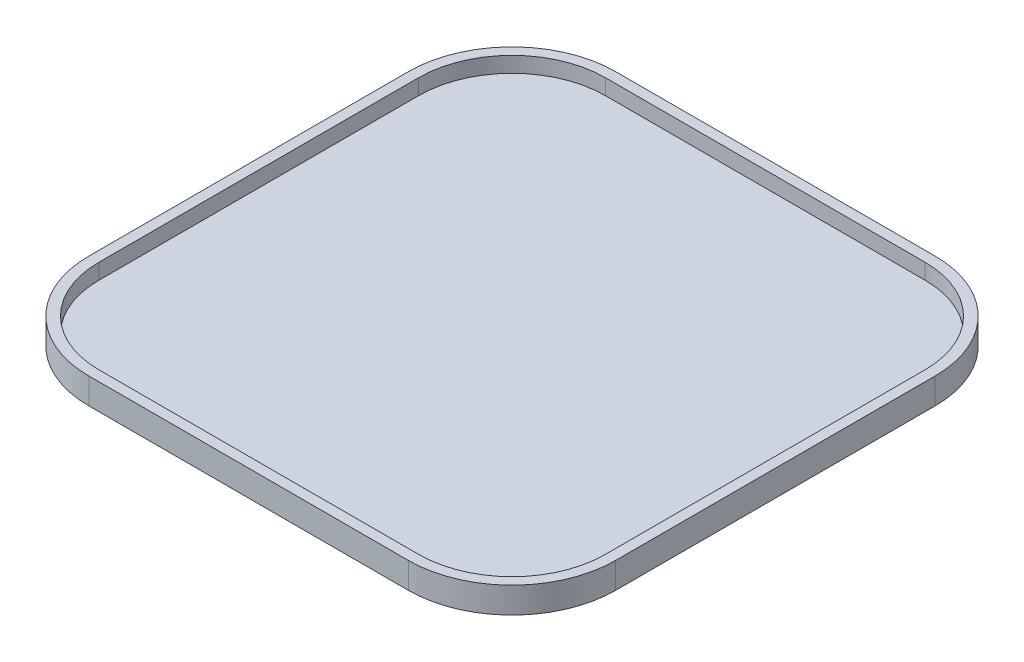
ISO-10303-21;
HEADER;
FILE_DESCRIPTION(('STEP AP214'),'2;1');
FILE_NAME('part.step','',(''),(''),'','','');
FILE_SCHEMA(('AUTOMOTIVE_DESIGN { 1 0 10303 214 1 1 1 1 }'));
ENDSEC;
DATA;
#1=APPLICATION_CONTEXT('core data for automotive mechanical design processes');
#2=APPLICATION_PROTOCOL_DEFINITION('international standard','automotive_design',2000,#1);
#3=PRODUCT_CONTEXT('',#1,'mechanical');
#4=PRODUCT('Part','Part','',(#3));
#5=PRODUCT_RELATED_PRODUCT_CATEGORY('part','',(#4));
#6=PRODUCT_DEFINITION_FORMATION('','',#4);
#7=PRODUCT_DEFINITION_CONTEXT('part definition',#1,'design');
#8=PRODUCT_DEFINITION('design','',#6,#7);
#9=PRODUCT_DEFINITION_SHAPE('','',#8);
#10=(LENGTH_UNIT() NAMED_UNIT(*) SI_UNIT(.MILLI.,.METRE.));
#11=(NAMED_UNIT(*) PLANE_ANGLE_UNIT() SI_UNIT($,.RADIAN.));
#12=(NAMED_UNIT(*) SI_UNIT($,.STERADIAN.) SOLID_ANGLE_UNIT());
#13=UNCERTAINTY_MEASURE_WITH_UNIT(LENGTH_MEASURE(1.E-05),#10,'distance_accuracy_value','');
#14=(GEOMETRIC_REPRESENTATION_CONTEXT(3) GLOBAL_UNCERTAINTY_ASSIGNED_CONTEXT((#13)) GLOBAL_UNIT_ASSIGNED_CONTEXT((#10,
#11,#12)) REPRESENTATION_CONTEXT('',''));
#15=CARTESIAN_POINT('',(0.,0.,0.));
#16=DIRECTION('',(0.,0.,1.));
#17=DIRECTION('',(1.,0.,0.));
#18=AXIS2_PLACEMENT_3D('',#15,#16,#17);
#19=CARTESIAN_POINT('',(30.8,5.,30.8));
#20=DIRECTION('',(0.,-1.,0.));
#21=DIRECTION('',(0.,0.,-1.));
#22=AXIS2_PLACEMENT_3D('',#19,#20,#21);
#23=CYLINDRICAL_SURFACE('',#22,20.);
#24=CARTESIAN_POINT('',(30.8,0.,30.8));
#25=DIRECTION('',(0.,1.,0.));
#26=DIRECTION('',(0.,0.,1.));
#27=AXIS2_PLACEMENT_3D('',#24,#25,#26);
#28=CIRCLE('',#27,20.);
#29=CARTESIAN_POINT('',(30.8,0.,50.8));
#30=VERTEX_POINT('',#29);
#31=CARTESIAN_POINT('',(50.8,0.,30.8));
#32=VERTEX_POINT('',#31);
#33=EDGE_CURVE('E142',#30,#32,#28,.T.);
#34=ORIENTED_EDGE('',*,*,#33,.T.);
#35=DIRECTION('',(0.,-1.,0.));
#36=VECTOR('',#35,1.);
#37=CARTESIAN_POINT('',(50.8,5.,30.8));
#38=LINE('',#37,#36);
#39=CARTESIAN_POINT('',(50.8,5.,30.8));
#40=VERTEX_POINT('',#39);
#41=EDGE_CURVE('E11',#40,#32,#38,.T.);
#42=ORIENTED_EDGE('',*,*,#41,.F.);
#43=CARTESIAN_POINT('',(30.8,5.,30.8));
#44=DIRECTION('',(0.,1.,0.));
#45=DIRECTION('',(0.,0.,1.));
#46=AXIS2_PLACEMENT_3D('',#43,#44,#45);
#47=CIRCLE('',#46,20.);
#48=CARTESIAN_POINT('',(30.8,5.,50.8));
#49=VERTEX_POINT('',#48);
#50=EDGE_CURVE('E158',#49,#40,#47,.T.);
#51=ORIENTED_EDGE('',*,*,#50,.F.);
#52=DIRECTION('',(0.,-1.,0.));
#53=VECTOR('',#52,1.);
#54=CARTESIAN_POINT('',(30.8,5.,50.8));
#55=LINE('',#54,#53);
#56=EDGE_CURVE('E138',#49,#30,#55,.T.);
#57=ORIENTED_EDGE('',*,*,#56,.T.);
#58=EDGE_LOOP('',(#34,#42,#51,#57));
#59=FACE_BOUND('',#58,.T.);
#60=ADVANCED_FACE('F35',(#59),#23,.T.);
#61=CARTESIAN_POINT('',(50.8,5.,30.8));
#62=DIRECTION('',(-1.,0.,0.));
#63=DIRECTION('',(0.,0.,1.));
#64=AXIS2_PLACEMENT_3D('',#61,#62,#63);
#65=PLANE('',#64);
#66=DIRECTION('',(0.,0.,-1.));
#67=VECTOR('',#66,1.);
#68=CARTESIAN_POINT('',(50.8,0.,30.8));
#69=LINE('',#68,#67);
#70=CARTESIAN_POINT('',(50.8,0.,-30.8));
#71=VERTEX_POINT('',#70);
#72=EDGE_CURVE('E145',#32,#71,#69,.T.);
#73=ORIENTED_EDGE('',*,*,#72,.T.);
#74=DIRECTION('',(0.,-1.,0.));
#75=VECTOR('',#74,1.);
#76=CARTESIAN_POINT('',(50.8,5.,-30.8));
#77=LINE('',#76,#75);
#78=CARTESIAN_POINT('',(50.8,5.,-30.8));
#79=VERTEX_POINT('',#78);
#80=EDGE_CURVE('E42',#79,#71,#77,.T.);
#81=ORIENTED_EDGE('',*,*,#80,.F.);
#82=DIRECTION('',(0.,0.,-1.));
#83=VECTOR('',#82,1.);
#84=CARTESIAN_POINT('',(50.8,5.,30.8));
#85=LINE('',#84,#83);
#86=EDGE_CURVE('E99',#40,#79,#85,.T.);
#87=ORIENTED_EDGE('',*,*,#86,.F.);
#88=ORIENTED_EDGE('',*,*,#41,.T.);
#89=EDGE_LOOP('',(#73,#81,#87,#88));
#90=FACE_BOUND('',#89,.T.);
#91=ADVANCED_FACE('F327',(#90),#65,.F.);
#92=CARTESIAN_POINT('',(30.8,5.,-30.8));
#93=DIRECTION('',(0.,-1.,0.));
#94=DIRECTION('',(0.,0.,-1.));
#95=AXIS2_PLACEMENT_3D('',#92,#93,#94);
#96=CYLINDRICAL_SURFACE('',#95,20.);
#97=CARTESIAN_POINT('',(30.8,0.,-30.8));
#98=DIRECTION('',(0.,1.,0.));
#99=DIRECTION('',(0.,0.,1.));
#100=AXIS2_PLACEMENT_3D('',#97,#98,#99);
#101=CIRCLE('',#100,20.);
#102=CARTESIAN_POINT('',(30.8,0.,-50.8));
#103=VERTEX_POINT('',#102);
#104=EDGE_CURVE('E148',#71,#103,#101,.T.);
#105=ORIENTED_EDGE('',*,*,#104,.T.);
#106=DIRECTION('',(0.,-1.,0.));
#107=VECTOR('',#106,1.);
#108=CARTESIAN_POINT('',(30.8,5.,-50.8));
#109=LINE('',#108,#107);
#110=CARTESIAN_POINT('',(30.8,5.,-50.8));
#111=VERTEX_POINT('',#110);
#112=EDGE_CURVE('E165',#111,#103,#109,.T.);
#113=ORIENTED_EDGE('',*,*,#112,.F.);
#114=CARTESIAN_POINT('',(30.8,5.,-30.8));
#115=DIRECTION('',(0.,1.,0.));
#116=DIRECTION('',(0.,0.,1.));
#117=AXIS2_PLACEMENT_3D('',#114,#115,#116);
#118=CIRCLE('',#117,20.);
#119=EDGE_CURVE('E173',#79,#111,#118,.T.);
#120=ORIENTED_EDGE('',*,*,#119,.F.);
#121=ORIENTED_EDGE('',*,*,#80,.T.);
#122=EDGE_LOOP('',(#105,#113,#120,#121));
#123=FACE_BOUND('',#122,.T.);
#124=ADVANCED_FACE('F171',(#123),#96,.T.);
#125=CARTESIAN_POINT('',(30.8,5.,-50.8));
#126=DIRECTION('',(0.,0.,1.));
#127=DIRECTION('',(1.,0.,0.));
#128=AXIS2_PLACEMENT_3D('',#125,#126,#127);
#129=PLANE('',#128);
#130=DIRECTION('',(-1.,0.,0.));
#131=VECTOR('',#130,1.);
#132=CARTESIAN_POINT('',(30.8,0.,-50.8));
#133=LINE('',#132,#131);
#134=CARTESIAN_POINT('',(-30.8,0.,-50.8));
#135=VERTEX_POINT('',#134);
#136=EDGE_CURVE('E150',#103,#135,#133,.T.);
#137=ORIENTED_EDGE('',*,*,#136,.T.);
#138=DIRECTION('',(0.,-1.,0.));
#139=VECTOR('',#138,1.);
#140=CARTESIAN_POINT('',(-30.8,5.,-50.8));
#141=LINE('',#140,#139);
#142=CARTESIAN_POINT('',(-30.8,5.,-50.8));
#143=VERTEX_POINT('',#142);
#144=EDGE_CURVE('E162',#143,#135,#141,.T.);
#145=ORIENTED_EDGE('',*,*,#144,.F.);
#146=DIRECTION('',(-1.,0.,0.));
#147=VECTOR('',#146,1.);
#148=CARTESIAN_POINT('',(30.8,5.,-50.8));
#149=LINE('',#148,#147);
#150=EDGE_CURVE('E185',#111,#143,#149,.T.);
#151=ORIENTED_EDGE('',*,*,#150,.F.);
#152=ORIENTED_EDGE('',*,*,#112,.T.);
#153=EDGE_LOOP('',(#137,#145,#151,#152));
#154=FACE_BOUND('',#153,.T.);
#155=ADVANCED_FACE('F181',(#154),#129,.F.);
#156=CARTESIAN_POINT('',(-30.8,5.,-30.8));
#157=DIRECTION('',(0.,-1.,0.));
#158=DIRECTION('',(0.,0.,-1.));
#159=AXIS2_PLACEMENT_3D('',#156,#157,#158);
#160=CYLINDRICAL_SURFACE('',#159,20.);
#161=CARTESIAN_POINT('',(-30.8,0.,-30.8));
#162=DIRECTION('',(0.,1.,0.));
#163=DIRECTION('',(0.,0.,1.));
#164=AXIS2_PLACEMENT_3D('',#161,#162,#163);
#165=CIRCLE('',#164,20.);
#166=CARTESIAN_POINT('',(-50.8,0.,-30.8));
#167=VERTEX_POINT('',#166);
#168=EDGE_CURVE('E152',#135,#167,#165,.T.);
#169=ORIENTED_EDGE('',*,*,#168,.T.);
#170=DIRECTION('',(0.,-1.,0.));
#171=VECTOR('',#170,1.);
#172=CARTESIAN_POINT('',(-50.8,5.,-30.8));
#173=LINE('',#172,#171);
#174=CARTESIAN_POINT('',(-50.8,5.,-30.8));
#175=VERTEX_POINT('',#174);
#176=EDGE_CURVE('E133',#175,#167,#173,.T.);
#177=ORIENTED_EDGE('',*,*,#176,.F.);
#178=CARTESIAN_POINT('',(-30.8,5.,-30.8));
#179=DIRECTION('',(0.,1.,0.));
#180=DIRECTION('',(0.,0.,1.));
#181=AXIS2_PLACEMENT_3D('',#178,#179,#180);
#182=CIRCLE('',#181,20.);
#183=EDGE_CURVE('E121',#143,#175,#182,.T.);
#184=ORIENTED_EDGE('',*,*,#183,.F.);
#185=ORIENTED_EDGE('',*,*,#144,.T.);
#186=EDGE_LOOP('',(#169,#177,#184,#185));
#187=FACE_BOUND('',#186,.T.);
#188=ADVANCED_FACE('F184',(#187),#160,.T.);
#189=CARTESIAN_POINT('',(-50.8,5.,30.8));
#190=DIRECTION('',(1.,0.,0.));
#191=DIRECTION('',(0.,0.,-1.));
#192=AXIS2_PLACEMENT_3D('',#189,#190,#191);
#193=PLANE('',#192);
#194=DIRECTION('',(0.,0.,1.));
#195=VECTOR('',#194,1.);
#196=CARTESIAN_POINT('',(-50.8,0.,30.8));
#197=LINE('',#196,#195);
#198=CARTESIAN_POINT('',(-50.8,0.,30.8));
#199=VERTEX_POINT('',#198);
#200=EDGE_CURVE('E130',#167,#199,#197,.T.);
#201=ORIENTED_EDGE('',*,*,#200,.T.);
#202=DIRECTION('',(0.,-1.,0.));
#203=VECTOR('',#202,1.);
#204=CARTESIAN_POINT('',(-50.8,5.,30.8));
#205=LINE('',#204,#203);
#206=CARTESIAN_POINT('',(-50.8,5.,30.8));
#207=VERTEX_POINT('',#206);
#208=EDGE_CURVE('E127',#207,#199,#205,.T.);
#209=ORIENTED_EDGE('',*,*,#208,.F.);
#210=DIRECTION('',(0.,0.,1.));
#211=VECTOR('',#210,1.);
#212=CARTESIAN_POINT('',(-50.8,5.,30.8));
#213=LINE('',#212,#211);
#214=EDGE_CURVE('E114',#175,#207,#213,.T.);
#215=ORIENTED_EDGE('',*,*,#214,.F.);
#216=ORIENTED_EDGE('',*,*,#176,.T.);
#217=EDGE_LOOP('',(#201,#209,#215,#216));
#218=FACE_BOUND('',#217,.T.);
#219=ADVANCED_FACE('F128',(#218),#193,.F.);
#220=CARTESIAN_POINT('',(-30.8,5.,30.8));
#221=DIRECTION('',(0.,-1.,0.));
#222=DIRECTION('',(0.,0.,-1.));
#223=AXIS2_PLACEMENT_3D('',#220,#221,#222);
#224=CYLINDRICAL_SURFACE('',#223,20.);
#225=CARTESIAN_POINT('',(-30.8,0.,30.8));
#226=DIRECTION('',(0.,1.,0.));
#227=DIRECTION('',(0.,0.,-1.));
#228=AXIS2_PLACEMENT_3D('',#225,#226,#227);
#229=CIRCLE('',#228,20.);
#230=CARTESIAN_POINT('',(-30.8,0.,50.8));
#231=VERTEX_POINT('',#230);
#232=EDGE_CURVE('E155',#199,#231,#229,.T.);
#233=ORIENTED_EDGE('',*,*,#232,.T.);
#234=DIRECTION('',(0.,-1.,0.));
#235=VECTOR('',#234,1.);
#236=CARTESIAN_POINT('',(-30.8,5.,50.8));
#237=LINE('',#236,#235);
#238=CARTESIAN_POINT('',(-30.8,5.,50.8));
#239=VERTEX_POINT('',#238);
#240=EDGE_CURVE('E134',#239,#231,#237,.T.);
#241=ORIENTED_EDGE('',*,*,#240,.F.);
#242=CARTESIAN_POINT('',(-30.8,5.,30.8));
#243=DIRECTION('',(0.,1.,0.));
#244=DIRECTION('',(0.,0.,-1.));
#245=AXIS2_PLACEMENT_3D('',#242,#243,#244);
#246=CIRCLE('',#245,20.);
#247=EDGE_CURVE('E118',#207,#239,#246,.T.);
#248=ORIENTED_EDGE('',*,*,#247,.F.);
#249=ORIENTED_EDGE('',*,*,#208,.T.);
#250=EDGE_LOOP('',(#233,#241,#248,#249));
#251=FACE_BOUND('',#250,.T.);
#252=ADVANCED_FACE('F136',(#251),#224,.T.);
#253=CARTESIAN_POINT('',(30.8,5.,50.8));
#254=DIRECTION('',(0.,0.,-1.));
#255=DIRECTION('',(-1.,0.,0.));
#256=AXIS2_PLACEMENT_3D('',#253,#254,#255);
#257=PLANE('',#256);
#258=DIRECTION('',(1.,0.,0.));
#259=VECTOR('',#258,1.);
#260=CARTESIAN_POINT('',(30.8,0.,50.8));
#261=LINE('',#260,#259);
#262=EDGE_CURVE('E91',#231,#30,#261,.T.);
#263=ORIENTED_EDGE('',*,*,#262,.T.);
#264=ORIENTED_EDGE('',*,*,#56,.F.);
#265=DIRECTION('',(1.,0.,0.));
#266=VECTOR('',#265,1.);
#267=CARTESIAN_POINT('',(30.8,5.,50.8));
#268=LINE('',#267,#266);
#269=EDGE_CURVE('E58',#239,#49,#268,.T.);
#270=ORIENTED_EDGE('',*,*,#269,.F.);
#271=ORIENTED_EDGE('',*,*,#240,.T.);
#272=EDGE_LOOP('',(#263,#264,#270,#271));
#273=FACE_BOUND('',#272,.T.);
#274=ADVANCED_FACE('F334',(#273),#257,.F.);
#275=CARTESIAN_POINT('',(30.8,5.,30.8));
#276=DIRECTION('',(0.,1.,0.));
#277=DIRECTION('',(0.,0.,1.));
#278=AXIS2_PLACEMENT_3D('',#275,#276,#277);
#279=PLANE('',#278);
#280=CARTESIAN_POINT('',(30.8,5.,30.8));
#281=DIRECTION('',(0.,1.,0.));
#282=DIRECTION('',(0.,0.,1.));
#283=AXIS2_PLACEMENT_3D('',#280,#281,#282);
#284=CIRCLE('',#283,18.);
#285=CARTESIAN_POINT('',(30.8,5.,48.8));
#286=VERTEX_POINT('',#285);
#287=CARTESIAN_POINT('',(48.8,5.,30.8));
#288=VERTEX_POINT('',#287);
#289=EDGE_CURVE('E211',#286,#288,#284,.T.);
#290=ORIENTED_EDGE('',*,*,#289,.F.);
#291=DIRECTION('',(1.,0.,0.));
#292=VECTOR('',#291,1.);
#293=CARTESIAN_POINT('',(30.8,5.,48.8));
#294=LINE('',#293,#292);
#295=CARTESIAN_POINT('',(-30.8,5.,48.8));
#296=VERTEX_POINT('',#295);
#297=EDGE_CURVE('E191',#296,#286,#294,.T.);
#298=ORIENTED_EDGE('',*,*,#297,.F.);
#299=CARTESIAN_POINT('',(-30.8,5.,30.8));
#300=DIRECTION('',(0.,1.,0.));
#301=DIRECTION('',(0.,0.,1.));
#302=AXIS2_PLACEMENT_3D('',#299,#300,#301);
#303=CIRCLE('',#302,18.);
#304=CARTESIAN_POINT('',(-48.8,5.,30.8));
#305=VERTEX_POINT('',#304);
#306=EDGE_CURVE('E194',#305,#296,#303,.T.);
#307=ORIENTED_EDGE('',*,*,#306,.F.);
#308=DIRECTION('',(0.,0.,1.));
#309=VECTOR('',#308,1.);
#310=CARTESIAN_POINT('',(-48.8,5.,30.8));
#311=LINE('',#310,#309);
#312=CARTESIAN_POINT('',(-48.8,5.,-30.8));
#313=VERTEX_POINT('',#312);
#314=EDGE_CURVE('E196',#313,#305,#311,.T.);
#315=ORIENTED_EDGE('',*,*,#314,.F.);
#316=CARTESIAN_POINT('',(-30.8,5.,-30.8));
#317=DIRECTION('',(0.,1.,0.));
#318=DIRECTION('',(0.,0.,1.));
#319=AXIS2_PLACEMENT_3D('',#316,#317,#318);
#320=CIRCLE('',#319,18.);
#321=CARTESIAN_POINT('',(-30.8,5.,-48.8));
#322=VERTEX_POINT('',#321);
#323=EDGE_CURVE('E199',#322,#313,#320,.T.);
#324=ORIENTED_EDGE('',*,*,#323,.F.);
#325=DIRECTION('',(-1.,0.,0.));
#326=VECTOR('',#325,1.);
#327=CARTESIAN_POINT('',(30.8,5.,-48.8));
#328=LINE('',#327,#326);
#329=CARTESIAN_POINT('',(30.8,5.,-48.8));
#330=VERTEX_POINT('',#329);
#331=EDGE_CURVE('E202',#330,#322,#328,.T.);
#332=ORIENTED_EDGE('',*,*,#331,.F.);
#333=CARTESIAN_POINT('',(30.8,5.,-30.8));
#334=DIRECTION('',(0.,1.,0.));
#335=DIRECTION('',(0.,0.,1.));
#336=AXIS2_PLACEMENT_3D('',#333,#334,#335);
#337=CIRCLE('',#336,18.);
#338=CARTESIAN_POINT('',(48.8,5.,-30.8));
#339=VERTEX_POINT('',#338);
#340=EDGE_CURVE('E205',#339,#330,#337,.T.);
#341=ORIENTED_EDGE('',*,*,#340,.F.);
#342=DIRECTION('',(0.,0.,-1.));
#343=VECTOR('',#342,1.);
#344=CARTESIAN_POINT('',(48.8,5.,30.8));
#345=LINE('',#344,#343);
#346=EDGE_CURVE('E208',#288,#339,#345,.T.);
#347=ORIENTED_EDGE('',*,*,#346,.F.);
#348=EDGE_LOOP('',(#290,#298,#307,#315,#324,#332,#341,#347));
#349=FACE_BOUND('',#348,.T.);
#350=ORIENTED_EDGE('',*,*,#50,.T.);
#351=ORIENTED_EDGE('',*,*,#86,.T.);
#352=ORIENTED_EDGE('',*,*,#119,.T.);
#353=ORIENTED_EDGE('',*,*,#150,.T.);
#354=ORIENTED_EDGE('',*,*,#183,.T.);
#355=ORIENTED_EDGE('',*,*,#214,.T.);
#356=ORIENTED_EDGE('',*,*,#247,.T.);
#357=ORIENTED_EDGE('',*,*,#269,.T.);
#358=EDGE_LOOP('',(#350,#351,#352,#353,#354,#355,#356,#357));
#359=FACE_BOUND('',#358,.T.);
#360=ADVANCED_FACE('F116',(#349,#359),#279,.T.);
#361=CARTESIAN_POINT('',(30.8,0.,30.8));
#362=DIRECTION('',(0.,1.,0.));
#363=DIRECTION('',(0.,0.,1.));
#364=AXIS2_PLACEMENT_3D('',#361,#362,#363);
#365=PLANE('',#364);
#366=ORIENTED_EDGE('',*,*,#33,.F.);
#367=ORIENTED_EDGE('',*,*,#262,.F.);
#368=ORIENTED_EDGE('',*,*,#232,.F.);
#369=ORIENTED_EDGE('',*,*,#200,.F.);
#370=ORIENTED_EDGE('',*,*,#168,.F.);
#371=ORIENTED_EDGE('',*,*,#136,.F.);
#372=ORIENTED_EDGE('',*,*,#104,.F.);
#373=ORIENTED_EDGE('',*,*,#72,.F.);
#374=EDGE_LOOP('',(#366,#367,#368,#369,#370,#371,#372,#373));
#375=FACE_BOUND('',#374,.T.);
#376=ADVANCED_FACE('F177',(#375),#365,.F.);
#377=CARTESIAN_POINT('',(30.8,5.,30.8));
#378=DIRECTION('',(0.,-1.,0.));
#379=DIRECTION('',(0.,0.,-1.));
#380=AXIS2_PLACEMENT_3D('',#377,#378,#379);
#381=CYLINDRICAL_SURFACE('',#380,18.);
#382=CARTESIAN_POINT('',(30.8,2.,30.8));
#383=DIRECTION('',(0.,1.,0.));
#384=DIRECTION('',(0.,0.,1.));
#385=AXIS2_PLACEMENT_3D('',#382,#383,#384);
#386=CIRCLE('',#385,18.);
#387=CARTESIAN_POINT('',(30.8,2.,48.8));
#388=VERTEX_POINT('',#387);
#389=CARTESIAN_POINT('',(48.8,2.,30.8));
#390=VERTEX_POINT('',#389);
#391=EDGE_CURVE('E251',#388,#390,#386,.T.);
#392=ORIENTED_EDGE('',*,*,#391,.F.);
#393=DIRECTION('',(0.,-1.,0.));
#394=VECTOR('',#393,1.);
#395=CARTESIAN_POINT('',(30.8,5.,48.8));
#396=LINE('',#395,#394);
#397=EDGE_CURVE('E193',#286,#388,#396,.T.);
#398=ORIENTED_EDGE('',*,*,#397,.F.);
#399=ORIENTED_EDGE('',*,*,#289,.T.);
#400=DIRECTION('',(0.,1.,0.));
#401=VECTOR('',#400,1.);
#402=CARTESIAN_POINT('',(48.8,5.,30.8));
#403=LINE('',#402,#401);
#404=EDGE_CURVE('E146',#288,#390,#403,.F.);
#405=ORIENTED_EDGE('',*,*,#404,.T.);
#406=EDGE_LOOP('',(#392,#398,#399,#405));
#407=FACE_BOUND('',#406,.T.);
#408=ADVANCED_FACE('F267',(#407),#381,.F.);
#409=CARTESIAN_POINT('',(48.8,5.,30.8));
#410=DIRECTION('',(-1.,0.,0.));
#411=DIRECTION('',(0.,0.,1.));
#412=AXIS2_PLACEMENT_3D('',#409,#410,#411);
#413=PLANE('',#412);
#414=DIRECTION('',(0.,0.,-1.));
#415=VECTOR('',#414,1.);
#416=CARTESIAN_POINT('',(48.8,2.,30.8));
#417=LINE('',#416,#415);
#418=CARTESIAN_POINT('',(48.8,2.,-30.8));
#419=VERTEX_POINT('',#418);
#420=EDGE_CURVE('E246',#390,#419,#417,.T.);
#421=ORIENTED_EDGE('',*,*,#420,.F.);
#422=ORIENTED_EDGE('',*,*,#404,.F.);
#423=ORIENTED_EDGE('',*,*,#346,.T.);
#424=DIRECTION('',(0.,-1.,0.));
#425=VECTOR('',#424,1.);
#426=CARTESIAN_POINT('',(48.8,5.,-30.8));
#427=LINE('',#426,#425);
#428=EDGE_CURVE('E243',#339,#419,#427,.T.);
#429=ORIENTED_EDGE('',*,*,#428,.T.);
#430=EDGE_LOOP('',(#421,#422,#423,#429));
#431=FACE_BOUND('',#430,.T.);
#432=ADVANCED_FACE('F297',(#431),#413,.T.);
#433=CARTESIAN_POINT('',(30.8,5.,-30.8));
#434=DIRECTION('',(0.,-1.,0.));
#435=DIRECTION('',(0.,0.,-1.));
#436=AXIS2_PLACEMENT_3D('',#433,#434,#435);
#437=CYLINDRICAL_SURFACE('',#436,18.);
#438=CARTESIAN_POINT('',(30.8,2.,-30.8));
#439=DIRECTION('',(0.,1.,0.));
#440=DIRECTION('',(0.,0.,1.));
#441=AXIS2_PLACEMENT_3D('',#438,#439,#440);
#442=CIRCLE('',#441,18.);
#443=CARTESIAN_POINT('',(30.8,2.,-48.8));
#444=VERTEX_POINT('',#443);
#445=EDGE_CURVE('E240',#419,#444,#442,.T.);
#446=ORIENTED_EDGE('',*,*,#445,.F.);
#447=ORIENTED_EDGE('',*,*,#428,.F.);
#448=ORIENTED_EDGE('',*,*,#340,.T.);
#449=DIRECTION('',(0.,1.,0.));
#450=VECTOR('',#449,1.);
#451=CARTESIAN_POINT('',(30.8,5.,-48.8));
#452=LINE('',#451,#450);
#453=EDGE_CURVE('E237',#330,#444,#452,.F.);
#454=ORIENTED_EDGE('',*,*,#453,.T.);
#455=EDGE_LOOP('',(#446,#447,#448,#454));
#456=FACE_BOUND('',#455,.T.);
#457=ADVANCED_FACE('F303',(#456),#437,.F.);
#458=CARTESIAN_POINT('',(30.8,5.,-48.8));
#459=DIRECTION('',(0.,0.,1.));
#460=DIRECTION('',(1.,0.,0.));
#461=AXIS2_PLACEMENT_3D('',#458,#459,#460);
#462=PLANE('',#461);
#463=DIRECTION('',(-1.,0.,0.));
#464=VECTOR('',#463,1.);
#465=CARTESIAN_POINT('',(30.8,2.,-48.8));
#466=LINE('',#465,#464);
#467=CARTESIAN_POINT('',(-30.8,2.,-48.8));
#468=VERTEX_POINT('',#467);
#469=EDGE_CURVE('E234',#444,#468,#466,.T.);
#470=ORIENTED_EDGE('',*,*,#469,.F.);
#471=ORIENTED_EDGE('',*,*,#453,.F.);
#472=ORIENTED_EDGE('',*,*,#331,.T.);
#473=DIRECTION('',(0.,-1.,0.));
#474=VECTOR('',#473,1.);
#475=CARTESIAN_POINT('',(-30.8,5.,-48.8));
#476=LINE('',#475,#474);
#477=EDGE_CURVE('E231',#322,#468,#476,.T.);
#478=ORIENTED_EDGE('',*,*,#477,.T.);
#479=EDGE_LOOP('',(#470,#471,#472,#478));
#480=FACE_BOUND('',#479,.T.);
#481=ADVANCED_FACE('F414',(#480),#462,.T.);
#482=CARTESIAN_POINT('',(-30.8,5.,-30.8));
#483=DIRECTION('',(0.,-1.,0.));
#484=DIRECTION('',(0.,0.,-1.));
#485=AXIS2_PLACEMENT_3D('',#482,#483,#484);
#486=CYLINDRICAL_SURFACE('',#485,18.);
#487=CARTESIAN_POINT('',(-30.8,2.,-30.8));
#488=DIRECTION('',(0.,1.,0.));
#489=DIRECTION('',(0.,0.,1.));
#490=AXIS2_PLACEMENT_3D('',#487,#488,#489);
#491=CIRCLE('',#490,18.);
#492=CARTESIAN_POINT('',(-48.8,2.,-30.8));
#493=VERTEX_POINT('',#492);
#494=EDGE_CURVE('E228',#468,#493,#491,.T.);
#495=ORIENTED_EDGE('',*,*,#494,.F.);
#496=ORIENTED_EDGE('',*,*,#477,.F.);
#497=ORIENTED_EDGE('',*,*,#323,.T.);
#498=DIRECTION('',(0.,1.,0.));
#499=VECTOR('',#498,1.);
#500=CARTESIAN_POINT('',(-48.8,5.,-30.8));
#501=LINE('',#500,#499);
#502=EDGE_CURVE('E225',#313,#493,#501,.F.);
#503=ORIENTED_EDGE('',*,*,#502,.T.);
#504=EDGE_LOOP('',(#495,#496,#497,#503));
#505=FACE_BOUND('',#504,.T.);
#506=ADVANCED_FACE('F324',(#505),#486,.F.);
#507=CARTESIAN_POINT('',(-48.8,5.,30.8));
#508=DIRECTION('',(1.,0.,0.));
#509=DIRECTION('',(0.,0.,-1.));
#510=AXIS2_PLACEMENT_3D('',#507,#508,#509);
#511=PLANE('',#510);
#512=DIRECTION('',(0.,0.,1.));
#513=VECTOR('',#512,1.);
#514=CARTESIAN_POINT('',(-48.8,2.,30.8));
#515=LINE('',#514,#513);
#516=CARTESIAN_POINT('',(-48.8,2.,30.8));
#517=VERTEX_POINT('',#516);
#518=EDGE_CURVE('E222',#493,#517,#515,.T.);
#519=ORIENTED_EDGE('',*,*,#518,.F.);
#520=ORIENTED_EDGE('',*,*,#502,.F.);
#521=ORIENTED_EDGE('',*,*,#314,.T.);
#522=DIRECTION('',(0.,-1.,0.));
#523=VECTOR('',#522,1.);
#524=CARTESIAN_POINT('',(-48.8,5.,30.8));
#525=LINE('',#524,#523);
#526=EDGE_CURVE('E219',#305,#517,#525,.T.);
#527=ORIENTED_EDGE('',*,*,#526,.T.);
#528=EDGE_LOOP('',(#519,#520,#521,#527));
#529=FACE_BOUND('',#528,.T.);
#530=ADVANCED_FACE('F314',(#529),#511,.T.);
#531=CARTESIAN_POINT('',(-30.8,5.,30.8));
#532=DIRECTION('',(0.,-1.,0.));
#533=DIRECTION('',(0.,0.,-1.));
#534=AXIS2_PLACEMENT_3D('',#531,#532,#533);
#535=CYLINDRICAL_SURFACE('',#534,18.);
#536=CARTESIAN_POINT('',(-30.8,2.,30.8));
#537=DIRECTION('',(0.,1.,0.));
#538=DIRECTION('',(0.,0.,1.));
#539=AXIS2_PLACEMENT_3D('',#536,#537,#538);
#540=CIRCLE('',#539,18.);
#541=CARTESIAN_POINT('',(-30.8,2.,48.8));
#542=VERTEX_POINT('',#541);
#543=EDGE_CURVE('E217',#517,#542,#540,.T.);
#544=ORIENTED_EDGE('',*,*,#543,.F.);
#545=ORIENTED_EDGE('',*,*,#526,.F.);
#546=ORIENTED_EDGE('',*,*,#306,.T.);
#547=DIRECTION('',(0.,1.,0.));
#548=VECTOR('',#547,1.);
#549=CARTESIAN_POINT('',(-30.8,5.,48.8));
#550=LINE('',#549,#548);
#551=EDGE_CURVE('E49',#296,#542,#550,.F.);
#552=ORIENTED_EDGE('',*,*,#551,.T.);
#553=EDGE_LOOP('',(#544,#545,#546,#552));
#554=FACE_BOUND('',#553,.T.);
#555=ADVANCED_FACE('F316',(#554),#535,.F.);
#556=CARTESIAN_POINT('',(30.8,5.,48.8));
#557=DIRECTION('',(0.,0.,-1.));
#558=DIRECTION('',(-1.,0.,0.));
#559=AXIS2_PLACEMENT_3D('',#556,#557,#558);
#560=PLANE('',#559);
#561=DIRECTION('',(1.,0.,0.));
#562=VECTOR('',#561,1.);
#563=CARTESIAN_POINT('',(30.8,2.,48.8));
#564=LINE('',#563,#562);
#565=EDGE_CURVE('E214',#542,#388,#564,.T.);
#566=ORIENTED_EDGE('',*,*,#565,.F.);
#567=ORIENTED_EDGE('',*,*,#551,.F.);
#568=ORIENTED_EDGE('',*,*,#297,.T.);
#569=ORIENTED_EDGE('',*,*,#397,.T.);
#570=EDGE_LOOP('',(#566,#567,#568,#569));
#571=FACE_BOUND('',#570,.T.);
#572=ADVANCED_FACE('F291',(#571),#560,.T.);
#573=CARTESIAN_POINT('',(30.8,2.,30.8));
#574=DIRECTION('',(0.,1.,0.));
#575=DIRECTION('',(0.,0.,1.));
#576=AXIS2_PLACEMENT_3D('',#573,#574,#575);
#577=PLANE('',#576);
#578=ORIENTED_EDGE('',*,*,#391,.T.);
#579=ORIENTED_EDGE('',*,*,#420,.T.);
#580=ORIENTED_EDGE('',*,*,#445,.T.);
#581=ORIENTED_EDGE('',*,*,#469,.T.);
#582=ORIENTED_EDGE('',*,*,#494,.T.);
#583=ORIENTED_EDGE('',*,*,#518,.T.);
#584=ORIENTED_EDGE('',*,*,#543,.T.);
#585=ORIENTED_EDGE('',*,*,#565,.T.);
#586=EDGE_LOOP('',(#578,#579,#580,#581,#582,#583,#584,#585));
#587=FACE_BOUND('',#586,.T.);
#588=ADVANCED_FACE('F260',(#587),#577,.T.);
#589=CLOSED_SHELL('',(#60,#91,#124,#155,#188,#219,#252,#274,#360,#376,#408,#432,#457,#481,#506,
#530,#555,#572,#588));
#590=MANIFOLD_SOLID_BREP('B2',#589);
#591=ADVANCED_BREP_SHAPE_REPRESENTATION('',(#18,#590),#14);
#592=SHAPE_DEFINITION_REPRESENTATION(#9,#591);
ENDSEC;
END-ISO-10303-21;
